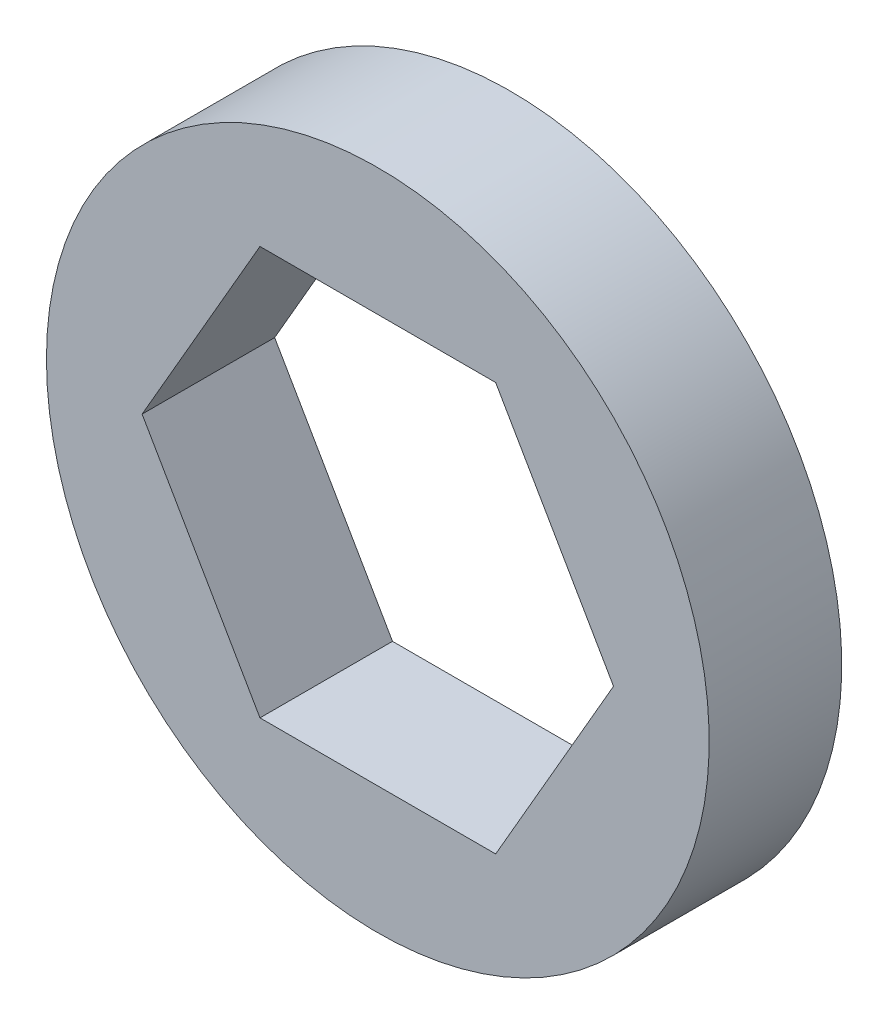
ISO-10303-21;
HEADER;
FILE_DESCRIPTION(('STEP AP214'),'2;1');
FILE_NAME('part.step','',(''),(''),'','','');
FILE_SCHEMA(('AUTOMOTIVE_DESIGN { 1 0 10303 214 1 1 1 1 }'));
ENDSEC;
DATA;
#1=APPLICATION_CONTEXT('core data for automotive mechanical design processes');
#2=APPLICATION_PROTOCOL_DEFINITION('international standard','automotive_design',2000,#1);
#3=PRODUCT_CONTEXT('',#1,'mechanical');
#4=PRODUCT('Part','Part','',(#3));
#5=PRODUCT_RELATED_PRODUCT_CATEGORY('part','',(#4));
#6=PRODUCT_DEFINITION_FORMATION('','',#4);
#7=PRODUCT_DEFINITION_CONTEXT('part definition',#1,'design');
#8=PRODUCT_DEFINITION('design','',#6,#7);
#9=PRODUCT_DEFINITION_SHAPE('','',#8);
#10=(LENGTH_UNIT() NAMED_UNIT(*) SI_UNIT(.MILLI.,.METRE.));
#11=(NAMED_UNIT(*) PLANE_ANGLE_UNIT() SI_UNIT($,.RADIAN.));
#12=(NAMED_UNIT(*) SI_UNIT($,.STERADIAN.) SOLID_ANGLE_UNIT());
#13=UNCERTAINTY_MEASURE_WITH_UNIT(LENGTH_MEASURE(1.E-05),#10,'distance_accuracy_value','');
#14=(GEOMETRIC_REPRESENTATION_CONTEXT(3) GLOBAL_UNCERTAINTY_ASSIGNED_CONTEXT((#13)) GLOBAL_UNIT_ASSIGNED_CONTEXT((#10,
#11,#12)) REPRESENTATION_CONTEXT('',''));
#15=CARTESIAN_POINT('',(0.,0.,0.));
#16=DIRECTION('',(0.,0.,1.));
#17=DIRECTION('',(1.,0.,0.));
#18=AXIS2_PLACEMENT_3D('',#15,#16,#17);
#19=CARTESIAN_POINT('',(0.,0.,-1.5875));
#20=DIRECTION('',(0.,0.,1.));
#21=DIRECTION('',(1.,0.,0.));
#22=AXIS2_PLACEMENT_3D('',#19,#20,#21);
#23=PLANE('',#22);
#24=DIRECTION('',(-0.5,-0.866025403784439,0.));
#25=VECTOR('',#24,1.);
#26=CARTESIAN_POINT('',(2.82295414120268,-4.8895,-1.5875));
#27=LINE('',#26,#25);
#28=CARTESIAN_POINT('',(5.64590828240535,0.,-1.5875));
#29=VERTEX_POINT('',#28);
#30=CARTESIAN_POINT('',(2.82295414120268,-4.8895,-1.5875));
#31=VERTEX_POINT('',#30);
#32=EDGE_CURVE('E73',#29,#31,#27,.T.);
#33=ORIENTED_EDGE('',*,*,#32,.F.);
#34=DIRECTION('',(0.500000000000001,-0.866025403784438,0.));
#35=VECTOR('',#34,1.);
#36=CARTESIAN_POINT('',(5.64590828240535,0.,-1.5875));
#37=LINE('',#36,#35);
#38=CARTESIAN_POINT('',(2.82295414120267,4.8895,-1.5875));
#39=VERTEX_POINT('',#38);
#40=EDGE_CURVE('E103',#39,#29,#37,.T.);
#41=ORIENTED_EDGE('',*,*,#40,.F.);
#42=DIRECTION('',(1.,0.,0.));
#43=VECTOR('',#42,1.);
#44=CARTESIAN_POINT('',(2.82295414120267,4.8895,-1.5875));
#45=LINE('',#44,#43);
#46=CARTESIAN_POINT('',(-2.82295414120268,4.8895,-1.5875));
#47=VERTEX_POINT('',#46);
#48=EDGE_CURVE('E111',#47,#39,#45,.T.);
#49=ORIENTED_EDGE('',*,*,#48,.F.);
#50=DIRECTION('',(0.5,0.866025403784439,0.));
#51=VECTOR('',#50,1.);
#52=CARTESIAN_POINT('',(-2.82295414120268,4.8895,-1.5875));
#53=LINE('',#52,#51);
#54=CARTESIAN_POINT('',(-5.64590828240535,0.,-1.5875));
#55=VERTEX_POINT('',#54);
#56=EDGE_CURVE('E116',#55,#47,#53,.T.);
#57=ORIENTED_EDGE('',*,*,#56,.F.);
#58=DIRECTION('',(-0.5,0.866025403784439,0.));
#59=VECTOR('',#58,1.);
#60=CARTESIAN_POINT('',(-5.64590828240535,0.,-1.5875));
#61=LINE('',#60,#59);
#62=CARTESIAN_POINT('',(-2.82295414120268,-4.8895,-1.5875));
#63=VERTEX_POINT('',#62);
#64=EDGE_CURVE('E68',#63,#55,#61,.T.);
#65=ORIENTED_EDGE('',*,*,#64,.F.);
#66=DIRECTION('',(-1.,0.,0.));
#67=VECTOR('',#66,1.);
#68=CARTESIAN_POINT('',(-2.82295414120268,-4.8895,-1.5875));
#69=LINE('',#68,#67);
#70=EDGE_CURVE('E70',#31,#63,#69,.T.);
#71=ORIENTED_EDGE('',*,*,#70,.F.);
#72=EDGE_LOOP('',(#33,#41,#49,#57,#65,#71));
#73=FACE_BOUND('',#72,.T.);
#74=CARTESIAN_POINT('',(0.,0.,-1.5875));
#75=DIRECTION('',(0.,0.,-1.));
#76=DIRECTION('',(-1.,0.,0.));
#77=AXIS2_PLACEMENT_3D('',#74,#75,#76);
#78=CIRCLE('',#77,7.9375);
#79=CARTESIAN_POINT('',(-7.9375,0.,-1.5875));
#80=VERTEX_POINT('',#79);
#81=EDGE_CURVE('E20',#80,#80,#78,.F.);
#82=ORIENTED_EDGE('',*,*,#81,.F.);
#83=EDGE_LOOP('',(#82));
#84=FACE_BOUND('',#83,.T.);
#85=ADVANCED_FACE('F17',(#73,#84),#23,.F.);
#86=CARTESIAN_POINT('',(0.,0.,1.5875));
#87=DIRECTION('',(0.,0.,-1.));
#88=DIRECTION('',(-1.,0.,0.));
#89=AXIS2_PLACEMENT_3D('',#86,#87,#88);
#90=CYLINDRICAL_SURFACE('',#89,7.9375);
#91=ORIENTED_EDGE('',*,*,#81,.T.);
#92=EDGE_LOOP('',(#91));
#93=FACE_BOUND('',#92,.T.);
#94=CARTESIAN_POINT('',(0.,0.,1.5875));
#95=DIRECTION('',(0.,0.,-1.));
#96=DIRECTION('',(-1.,0.,0.));
#97=AXIS2_PLACEMENT_3D('',#94,#95,#96);
#98=CIRCLE('',#97,7.9375);
#99=CARTESIAN_POINT('',(-7.9375,0.,1.5875));
#100=VERTEX_POINT('',#99);
#101=EDGE_CURVE('E95',#100,#100,#98,.F.);
#102=ORIENTED_EDGE('',*,*,#101,.F.);
#103=EDGE_LOOP('',(#102));
#104=FACE_BOUND('',#103,.T.);
#105=ADVANCED_FACE('F153',(#93,#104),#90,.T.);
#106=CARTESIAN_POINT('',(2.82295414120268,-4.8895,1.5875));
#107=DIRECTION('',(-0.866025403784439,0.5,0.));
#108=DIRECTION('',(-0.5,-0.866025403784439,0.));
#109=AXIS2_PLACEMENT_3D('',#106,#107,#108);
#110=PLANE('',#109);
#111=DIRECTION('',(-0.5,-0.866025403784439,0.));
#112=VECTOR('',#111,1.);
#113=CARTESIAN_POINT('',(5.64590828240535,0.,1.5875));
#114=LINE('',#113,#112);
#115=CARTESIAN_POINT('',(5.64590828240535,0.,1.5875));
#116=VERTEX_POINT('',#115);
#117=CARTESIAN_POINT('',(2.82295414120268,-4.8895,1.5875));
#118=VERTEX_POINT('',#117);
#119=EDGE_CURVE('E97',#116,#118,#114,.T.);
#120=ORIENTED_EDGE('',*,*,#119,.F.);
#121=DIRECTION('',(0.,0.,1.));
#122=VECTOR('',#121,1.);
#123=CARTESIAN_POINT('',(5.64590828240535,0.,1.5875));
#124=LINE('',#123,#122);
#125=EDGE_CURVE('E84',#29,#116,#124,.T.);
#126=ORIENTED_EDGE('',*,*,#125,.F.);
#127=ORIENTED_EDGE('',*,*,#32,.T.);
#128=DIRECTION('',(0.,0.,1.));
#129=VECTOR('',#128,1.);
#130=CARTESIAN_POINT('',(2.82295414120268,-4.8895,1.5875));
#131=LINE('',#130,#129);
#132=EDGE_CURVE('E78',#118,#31,#131,.F.);
#133=ORIENTED_EDGE('',*,*,#132,.F.);
#134=EDGE_LOOP('',(#120,#126,#127,#133));
#135=FACE_BOUND('',#134,.T.);
#136=ADVANCED_FACE('F81',(#135),#110,.T.);
#137=CARTESIAN_POINT('',(-2.82295414120268,-4.8895,1.5875));
#138=DIRECTION('',(0.,1.,0.));
#139=DIRECTION('',(-1.,0.,0.));
#140=AXIS2_PLACEMENT_3D('',#137,#138,#139);
#141=PLANE('',#140);
#142=DIRECTION('',(1.,0.,0.));
#143=VECTOR('',#142,1.);
#144=CARTESIAN_POINT('',(0.,-4.8895,1.5875));
#145=LINE('',#144,#143);
#146=CARTESIAN_POINT('',(-2.82295414120268,-4.8895,1.5875));
#147=VERTEX_POINT('',#146);
#148=EDGE_CURVE('E89',#118,#147,#145,.F.);
#149=ORIENTED_EDGE('',*,*,#148,.F.);
#150=ORIENTED_EDGE('',*,*,#132,.T.);
#151=ORIENTED_EDGE('',*,*,#70,.T.);
#152=DIRECTION('',(0.,0.,1.));
#153=VECTOR('',#152,1.);
#154=CARTESIAN_POINT('',(-2.82295414120268,-4.8895,1.5875));
#155=LINE('',#154,#153);
#156=EDGE_CURVE('E92',#147,#63,#155,.F.);
#157=ORIENTED_EDGE('',*,*,#156,.F.);
#158=EDGE_LOOP('',(#149,#150,#151,#157));
#159=FACE_BOUND('',#158,.T.);
#160=ADVANCED_FACE('F87',(#159),#141,.T.);
#161=CARTESIAN_POINT('',(-5.64590828240535,0.,1.5875));
#162=DIRECTION('',(0.866025403784439,0.5,0.));
#163=DIRECTION('',(-0.5,0.866025403784439,0.));
#164=AXIS2_PLACEMENT_3D('',#161,#162,#163);
#165=PLANE('',#164);
#166=DIRECTION('',(-0.5,0.866025403784439,0.));
#167=VECTOR('',#166,1.);
#168=CARTESIAN_POINT('',(-2.82295414120268,-4.8895,1.5875));
#169=LINE('',#168,#167);
#170=CARTESIAN_POINT('',(-5.64590828240535,0.,1.5875));
#171=VERTEX_POINT('',#170);
#172=EDGE_CURVE('E122',#147,#171,#169,.T.);
#173=ORIENTED_EDGE('',*,*,#172,.F.);
#174=ORIENTED_EDGE('',*,*,#156,.T.);
#175=ORIENTED_EDGE('',*,*,#64,.T.);
#176=DIRECTION('',(0.,0.,1.));
#177=VECTOR('',#176,1.);
#178=CARTESIAN_POINT('',(-5.64590828240535,0.,1.5875));
#179=LINE('',#178,#177);
#180=EDGE_CURVE('E113',#171,#55,#179,.F.);
#181=ORIENTED_EDGE('',*,*,#180,.F.);
#182=EDGE_LOOP('',(#173,#174,#175,#181));
#183=FACE_BOUND('',#182,.T.);
#184=ADVANCED_FACE('F120',(#183),#165,.T.);
#185=CARTESIAN_POINT('',(-2.82295414120268,4.8895,1.5875));
#186=DIRECTION('',(0.866025403784439,-0.5,0.));
#187=DIRECTION('',(0.5,0.866025403784439,0.));
#188=AXIS2_PLACEMENT_3D('',#185,#186,#187);
#189=PLANE('',#188);
#190=DIRECTION('',(0.5,0.866025403784439,0.));
#191=VECTOR('',#190,1.);
#192=CARTESIAN_POINT('',(-5.64590828240535,0.,1.5875));
#193=LINE('',#192,#191);
#194=CARTESIAN_POINT('',(-2.82295414120268,4.8895,1.5875));
#195=VERTEX_POINT('',#194);
#196=EDGE_CURVE('E126',#171,#195,#193,.T.);
#197=ORIENTED_EDGE('',*,*,#196,.F.);
#198=ORIENTED_EDGE('',*,*,#180,.T.);
#199=ORIENTED_EDGE('',*,*,#56,.T.);
#200=DIRECTION('',(0.,0.,1.));
#201=VECTOR('',#200,1.);
#202=CARTESIAN_POINT('',(-2.82295414120268,4.8895,1.5875));
#203=LINE('',#202,#201);
#204=EDGE_CURVE('E108',#195,#47,#203,.F.);
#205=ORIENTED_EDGE('',*,*,#204,.F.);
#206=EDGE_LOOP('',(#197,#198,#199,#205));
#207=FACE_BOUND('',#206,.T.);
#208=ADVANCED_FACE('F134',(#207),#189,.T.);
#209=CARTESIAN_POINT('',(2.82295414120267,4.8895,1.5875));
#210=DIRECTION('',(0.,-1.,0.));
#211=DIRECTION('',(1.,0.,0.));
#212=AXIS2_PLACEMENT_3D('',#209,#210,#211);
#213=PLANE('',#212);
#214=DIRECTION('',(1.,0.,0.));
#215=VECTOR('',#214,1.);
#216=CARTESIAN_POINT('',(0.,4.8895,1.5875));
#217=LINE('',#216,#215);
#218=CARTESIAN_POINT('',(2.82295414120267,4.8895,1.5875));
#219=VERTEX_POINT('',#218);
#220=EDGE_CURVE('E26',#195,#219,#217,.T.);
#221=ORIENTED_EDGE('',*,*,#220,.F.);
#222=ORIENTED_EDGE('',*,*,#204,.T.);
#223=ORIENTED_EDGE('',*,*,#48,.T.);
#224=DIRECTION('',(0.,0.,1.));
#225=VECTOR('',#224,1.);
#226=CARTESIAN_POINT('',(2.82295414120267,4.8895,1.5875));
#227=LINE('',#226,#225);
#228=EDGE_CURVE('E35',#219,#39,#227,.F.);
#229=ORIENTED_EDGE('',*,*,#228,.F.);
#230=EDGE_LOOP('',(#221,#222,#223,#229));
#231=FACE_BOUND('',#230,.T.);
#232=ADVANCED_FACE('F132',(#231),#213,.T.);
#233=CARTESIAN_POINT('',(5.64590828240535,0.,1.5875));
#234=DIRECTION('',(-0.866025403784438,-0.500000000000001,0.));
#235=DIRECTION('',(0.500000000000001,-0.866025403784438,0.));
#236=AXIS2_PLACEMENT_3D('',#233,#234,#235);
#237=PLANE('',#236);
#238=DIRECTION('',(0.5,-0.866025403784438,0.));
#239=VECTOR('',#238,1.);
#240=CARTESIAN_POINT('',(2.82295414120267,4.8895,1.5875));
#241=LINE('',#240,#239);
#242=EDGE_CURVE('E11',#219,#116,#241,.T.);
#243=ORIENTED_EDGE('',*,*,#242,.F.);
#244=ORIENTED_EDGE('',*,*,#228,.T.);
#245=ORIENTED_EDGE('',*,*,#40,.T.);
#246=ORIENTED_EDGE('',*,*,#125,.T.);
#247=EDGE_LOOP('',(#243,#244,#245,#246));
#248=FACE_BOUND('',#247,.T.);
#249=ADVANCED_FACE('F135',(#248),#237,.T.);
#250=CARTESIAN_POINT('',(0.,0.,1.5875));
#251=DIRECTION('',(0.,0.,1.));
#252=DIRECTION('',(1.,0.,0.));
#253=AXIS2_PLACEMENT_3D('',#250,#251,#252);
#254=PLANE('',#253);
#255=ORIENTED_EDGE('',*,*,#220,.T.);
#256=ORIENTED_EDGE('',*,*,#242,.T.);
#257=ORIENTED_EDGE('',*,*,#119,.T.);
#258=ORIENTED_EDGE('',*,*,#148,.T.);
#259=ORIENTED_EDGE('',*,*,#172,.T.);
#260=ORIENTED_EDGE('',*,*,#196,.T.);
#261=EDGE_LOOP('',(#255,#256,#257,#258,#259,#260));
#262=FACE_BOUND('',#261,.T.);
#263=ORIENTED_EDGE('',*,*,#101,.T.);
#264=EDGE_LOOP('',(#263));
#265=FACE_BOUND('',#264,.T.);
#266=ADVANCED_FACE('F129',(#262,#265),#254,.T.);
#267=CLOSED_SHELL('',(#85,#105,#136,#160,#184,#208,#232,#249,#266));
#268=MANIFOLD_SOLID_BREP('B1',#267);
#269=ADVANCED_BREP_SHAPE_REPRESENTATION('',(#18,#268),#14);
#270=SHAPE_DEFINITION_REPRESENTATION(#9,#269);
ENDSEC;
END-ISO-10303-21;
